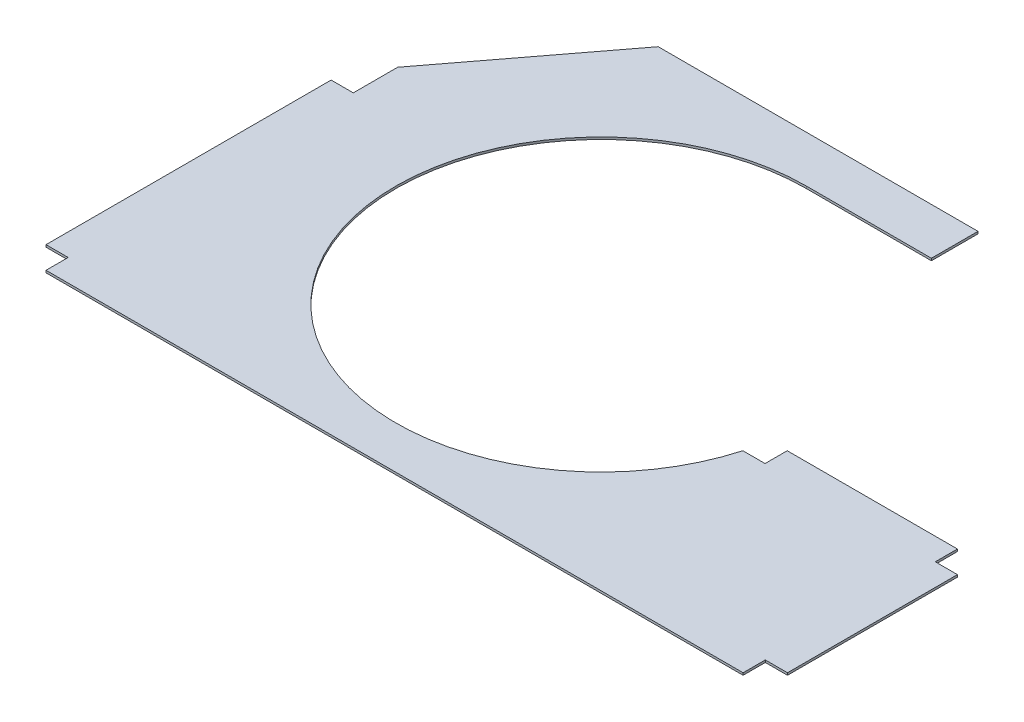
ISO-10303-21;
HEADER;
FILE_DESCRIPTION(('STEP AP214'),'2;1');
FILE_NAME('part.step','',(''),(''),'','','');
FILE_SCHEMA(('AUTOMOTIVE_DESIGN { 1 0 10303 214 1 1 1 1 }'));
ENDSEC;
DATA;
#1=APPLICATION_CONTEXT('core data for automotive mechanical design processes');
#2=APPLICATION_PROTOCOL_DEFINITION('international standard','automotive_design',2000,#1);
#3=PRODUCT_CONTEXT('',#1,'mechanical');
#4=PRODUCT('Part','Part','',(#3));
#5=PRODUCT_RELATED_PRODUCT_CATEGORY('part','',(#4));
#6=PRODUCT_DEFINITION_FORMATION('','',#4);
#7=PRODUCT_DEFINITION_CONTEXT('part definition',#1,'design');
#8=PRODUCT_DEFINITION('design','',#6,#7);
#9=PRODUCT_DEFINITION_SHAPE('','',#8);
#10=(LENGTH_UNIT() NAMED_UNIT(*) SI_UNIT(.MILLI.,.METRE.));
#11=(NAMED_UNIT(*) PLANE_ANGLE_UNIT() SI_UNIT($,.RADIAN.));
#12=(NAMED_UNIT(*) SI_UNIT($,.STERADIAN.) SOLID_ANGLE_UNIT());
#13=UNCERTAINTY_MEASURE_WITH_UNIT(LENGTH_MEASURE(1.E-05),#10,'distance_accuracy_value','');
#14=(GEOMETRIC_REPRESENTATION_CONTEXT(3) GLOBAL_UNCERTAINTY_ASSIGNED_CONTEXT((#13)) GLOBAL_UNIT_ASSIGNED_CONTEXT((#10,
#11,#12)) REPRESENTATION_CONTEXT('',''));
#15=CARTESIAN_POINT('',(0.,0.,0.));
#16=DIRECTION('',(0.,0.,1.));
#17=DIRECTION('',(1.,0.,0.));
#18=AXIS2_PLACEMENT_3D('',#15,#16,#17);
#19=CARTESIAN_POINT('',(0.,2.,0.));
#20=DIRECTION('',(1.,0.,0.));
#21=DIRECTION('',(0.,0.,-1.));
#22=AXIS2_PLACEMENT_3D('',#19,#20,#21);
#23=PLANE('',#22);
#24=DIRECTION('',(0.,0.,1.));
#25=VECTOR('',#24,1.);
#26=CARTESIAN_POINT('',(0.,0.,0.));
#27=LINE('',#26,#25);
#28=CARTESIAN_POINT('',(0.,0.,-257.));
#29=VERTEX_POINT('',#28);
#30=CARTESIAN_POINT('',(0.,0.,0.));
#31=VERTEX_POINT('',#30);
#32=EDGE_CURVE('E203',#29,#31,#27,.T.);
#33=ORIENTED_EDGE('',*,*,#32,.T.);
#34=DIRECTION('',(0.,-1.,0.));
#35=VECTOR('',#34,1.);
#36=CARTESIAN_POINT('',(0.,2.,0.));
#37=LINE('',#36,#35);
#38=CARTESIAN_POINT('',(0.,2.,0.));
#39=VERTEX_POINT('',#38);
#40=EDGE_CURVE('E11',#39,#31,#37,.T.);
#41=ORIENTED_EDGE('',*,*,#40,.F.);
#42=DIRECTION('',(0.,0.,1.));
#43=VECTOR('',#42,1.);
#44=CARTESIAN_POINT('',(0.,2.,0.));
#45=LINE('',#44,#43);
#46=CARTESIAN_POINT('',(0.,2.,-257.));
#47=VERTEX_POINT('',#46);
#48=EDGE_CURVE('E240',#47,#39,#45,.T.);
#49=ORIENTED_EDGE('',*,*,#48,.F.);
#50=DIRECTION('',(0.,-1.,0.));
#51=VECTOR('',#50,1.);
#52=CARTESIAN_POINT('',(0.,2.,-257.));
#53=LINE('',#52,#51);
#54=EDGE_CURVE('E197',#47,#29,#53,.T.);
#55=ORIENTED_EDGE('',*,*,#54,.T.);
#56=EDGE_LOOP('',(#33,#41,#49,#55));
#57=FACE_BOUND('',#56,.T.);
#58=ADVANCED_FACE('F39',(#57),#23,.F.);
#59=CARTESIAN_POINT('',(0.,2.,0.));
#60=DIRECTION('',(0.,0.,-1.));
#61=DIRECTION('',(-1.,0.,0.));
#62=AXIS2_PLACEMENT_3D('',#59,#60,#61);
#63=PLANE('',#62);
#64=DIRECTION('',(1.,0.,0.));
#65=VECTOR('',#64,1.);
#66=CARTESIAN_POINT('',(0.,0.,0.));
#67=LINE('',#66,#65);
#68=CARTESIAN_POINT('',(20.,0.,0.));
#69=VERTEX_POINT('',#68);
#70=EDGE_CURVE('E204',#31,#69,#67,.T.);
#71=ORIENTED_EDGE('',*,*,#70,.T.);
#72=DIRECTION('',(0.,-1.,0.));
#73=VECTOR('',#72,1.);
#74=CARTESIAN_POINT('',(20.,2.,0.));
#75=LINE('',#74,#73);
#76=CARTESIAN_POINT('',(20.,2.,0.));
#77=VERTEX_POINT('',#76);
#78=EDGE_CURVE('E50',#77,#69,#75,.T.);
#79=ORIENTED_EDGE('',*,*,#78,.F.);
#80=DIRECTION('',(1.,0.,0.));
#81=VECTOR('',#80,1.);
#82=CARTESIAN_POINT('',(0.,2.,0.));
#83=LINE('',#82,#81);
#84=EDGE_CURVE('E133',#39,#77,#83,.T.);
#85=ORIENTED_EDGE('',*,*,#84,.F.);
#86=ORIENTED_EDGE('',*,*,#40,.T.);
#87=EDGE_LOOP('',(#71,#79,#85,#86));
#88=FACE_BOUND('',#87,.T.);
#89=ADVANCED_FACE('F348',(#88),#63,.F.);
#90=CARTESIAN_POINT('',(20.,2.,0.));
#91=DIRECTION('',(1.,0.,0.));
#92=DIRECTION('',(0.,0.,-1.));
#93=AXIS2_PLACEMENT_3D('',#90,#91,#92);
#94=PLANE('',#93);
#95=DIRECTION('',(0.,0.,1.));
#96=VECTOR('',#95,1.);
#97=CARTESIAN_POINT('',(20.,0.,0.));
#98=LINE('',#97,#96);
#99=CARTESIAN_POINT('',(20.,0.,20.));
#100=VERTEX_POINT('',#99);
#101=EDGE_CURVE('E206',#69,#100,#98,.T.);
#102=ORIENTED_EDGE('',*,*,#101,.T.);
#103=DIRECTION('',(0.,-1.,0.));
#104=VECTOR('',#103,1.);
#105=CARTESIAN_POINT('',(20.,2.,20.));
#106=LINE('',#105,#104);
#107=CARTESIAN_POINT('',(20.,2.,20.));
#108=VERTEX_POINT('',#107);
#109=EDGE_CURVE('E280',#108,#100,#106,.T.);
#110=ORIENTED_EDGE('',*,*,#109,.F.);
#111=DIRECTION('',(0.,0.,1.));
#112=VECTOR('',#111,1.);
#113=CARTESIAN_POINT('',(20.,2.,0.));
#114=LINE('',#113,#112);
#115=EDGE_CURVE('E281',#77,#108,#114,.T.);
#116=ORIENTED_EDGE('',*,*,#115,.F.);
#117=ORIENTED_EDGE('',*,*,#78,.T.);
#118=EDGE_LOOP('',(#102,#110,#116,#117));
#119=FACE_BOUND('',#118,.T.);
#120=ADVANCED_FACE('F282',(#119),#94,.F.);
#121=CARTESIAN_POINT('',(20.,2.,20.));
#122=DIRECTION('',(0.,0.,-1.));
#123=DIRECTION('',(-1.,0.,0.));
#124=AXIS2_PLACEMENT_3D('',#121,#122,#123);
#125=PLANE('',#124);
#126=DIRECTION('',(1.,0.,0.));
#127=VECTOR('',#126,1.);
#128=CARTESIAN_POINT('',(20.,0.,20.));
#129=LINE('',#128,#127);
#130=CARTESIAN_POINT('',(648.38,0.,20.));
#131=VERTEX_POINT('',#130);
#132=EDGE_CURVE('E208',#100,#131,#129,.T.);
#133=ORIENTED_EDGE('',*,*,#132,.T.);
#134=DIRECTION('',(0.,-1.,0.));
#135=VECTOR('',#134,1.);
#136=CARTESIAN_POINT('',(648.38,2.,20.));
#137=LINE('',#136,#135);
#138=CARTESIAN_POINT('',(648.38,2.,20.));
#139=VERTEX_POINT('',#138);
#140=EDGE_CURVE('E273',#139,#131,#137,.T.);
#141=ORIENTED_EDGE('',*,*,#140,.F.);
#142=DIRECTION('',(1.,0.,0.));
#143=VECTOR('',#142,1.);
#144=CARTESIAN_POINT('',(20.,2.,20.));
#145=LINE('',#144,#143);
#146=EDGE_CURVE('E304',#108,#139,#145,.T.);
#147=ORIENTED_EDGE('',*,*,#146,.F.);
#148=ORIENTED_EDGE('',*,*,#109,.T.);
#149=EDGE_LOOP('',(#133,#141,#147,#148));
#150=FACE_BOUND('',#149,.T.);
#151=ADVANCED_FACE('F294',(#150),#125,.F.);
#152=CARTESIAN_POINT('',(648.38,2.,20.));
#153=DIRECTION('',(-1.,0.,0.));
#154=DIRECTION('',(0.,0.,1.));
#155=AXIS2_PLACEMENT_3D('',#152,#153,#154);
#156=PLANE('',#155);
#157=DIRECTION('',(0.,0.,-1.));
#158=VECTOR('',#157,1.);
#159=CARTESIAN_POINT('',(648.38,0.,20.));
#160=LINE('',#159,#158);
#161=CARTESIAN_POINT('',(648.38,0.,0.));
#162=VERTEX_POINT('',#161);
#163=EDGE_CURVE('E209',#131,#162,#160,.T.);
#164=ORIENTED_EDGE('',*,*,#163,.T.);
#165=DIRECTION('',(0.,-1.,0.));
#166=VECTOR('',#165,1.);
#167=CARTESIAN_POINT('',(648.38,2.,0.));
#168=LINE('',#167,#166);
#169=CARTESIAN_POINT('',(648.38,2.,0.));
#170=VERTEX_POINT('',#169);
#171=EDGE_CURVE('E271',#170,#162,#168,.T.);
#172=ORIENTED_EDGE('',*,*,#171,.F.);
#173=DIRECTION('',(0.,0.,-1.));
#174=VECTOR('',#173,1.);
#175=CARTESIAN_POINT('',(648.38,2.,20.));
#176=LINE('',#175,#174);
#177=EDGE_CURVE('E296',#139,#170,#176,.T.);
#178=ORIENTED_EDGE('',*,*,#177,.F.);
#179=ORIENTED_EDGE('',*,*,#140,.T.);
#180=EDGE_LOOP('',(#164,#172,#178,#179));
#181=FACE_BOUND('',#180,.T.);
#182=ADVANCED_FACE('F297',(#181),#156,.F.);
#183=CARTESIAN_POINT('',(648.38,2.,0.));
#184=DIRECTION('',(0.,0.,-1.));
#185=DIRECTION('',(-1.,0.,0.));
#186=AXIS2_PLACEMENT_3D('',#183,#184,#185);
#187=PLANE('',#186);
#188=DIRECTION('',(1.,0.,0.));
#189=VECTOR('',#188,1.);
#190=CARTESIAN_POINT('',(648.38,0.,0.));
#191=LINE('',#190,#189);
#192=CARTESIAN_POINT('',(668.38,0.,0.));
#193=VERTEX_POINT('',#192);
#194=EDGE_CURVE('E215',#162,#193,#191,.T.);
#195=ORIENTED_EDGE('',*,*,#194,.T.);
#196=DIRECTION('',(0.,-1.,0.));
#197=VECTOR('',#196,1.);
#198=CARTESIAN_POINT('',(668.38,2.,0.));
#199=LINE('',#198,#197);
#200=CARTESIAN_POINT('',(668.38,2.,0.));
#201=VERTEX_POINT('',#200);
#202=EDGE_CURVE('E268',#201,#193,#199,.T.);
#203=ORIENTED_EDGE('',*,*,#202,.F.);
#204=DIRECTION('',(1.,0.,0.));
#205=VECTOR('',#204,1.);
#206=CARTESIAN_POINT('',(648.38,2.,0.));
#207=LINE('',#206,#205);
#208=EDGE_CURVE('E302',#170,#201,#207,.T.);
#209=ORIENTED_EDGE('',*,*,#208,.F.);
#210=ORIENTED_EDGE('',*,*,#171,.T.);
#211=EDGE_LOOP('',(#195,#203,#209,#210));
#212=FACE_BOUND('',#211,.T.);
#213=ADVANCED_FACE('F361',(#212),#187,.F.);
#214=CARTESIAN_POINT('',(668.38,2.,0.));
#215=DIRECTION('',(-1.,0.,0.));
#216=DIRECTION('',(0.,0.,1.));
#217=AXIS2_PLACEMENT_3D('',#214,#215,#216);
#218=PLANE('',#217);
#219=DIRECTION('',(0.,0.,-1.));
#220=VECTOR('',#219,1.);
#221=CARTESIAN_POINT('',(668.38,0.,0.));
#222=LINE('',#221,#220);
#223=CARTESIAN_POINT('',(668.38,0.,-153.21));
#224=VERTEX_POINT('',#223);
#225=EDGE_CURVE('E212',#193,#224,#222,.T.);
#226=ORIENTED_EDGE('',*,*,#225,.T.);
#227=DIRECTION('',(0.,-1.,0.));
#228=VECTOR('',#227,1.);
#229=CARTESIAN_POINT('',(668.38,2.,-153.21));
#230=LINE('',#229,#228);
#231=CARTESIAN_POINT('',(668.38,2.,-153.21));
#232=VERTEX_POINT('',#231);
#233=EDGE_CURVE('E264',#232,#224,#230,.T.);
#234=ORIENTED_EDGE('',*,*,#233,.F.);
#235=DIRECTION('',(0.,0.,-1.));
#236=VECTOR('',#235,1.);
#237=CARTESIAN_POINT('',(668.38,2.,0.));
#238=LINE('',#237,#236);
#239=EDGE_CURVE('E305',#201,#232,#238,.T.);
#240=ORIENTED_EDGE('',*,*,#239,.F.);
#241=ORIENTED_EDGE('',*,*,#202,.T.);
#242=EDGE_LOOP('',(#226,#234,#240,#241));
#243=FACE_BOUND('',#242,.T.);
#244=ADVANCED_FACE('F368',(#243),#218,.F.);
#245=CARTESIAN_POINT('',(668.38,2.,-153.21));
#246=DIRECTION('',(0.,0.,1.));
#247=DIRECTION('',(1.,0.,0.));
#248=AXIS2_PLACEMENT_3D('',#245,#246,#247);
#249=PLANE('',#248);
#250=DIRECTION('',(-1.,0.,0.));
#251=VECTOR('',#250,1.);
#252=CARTESIAN_POINT('',(668.38,0.,-153.21));
#253=LINE('',#252,#251);
#254=CARTESIAN_POINT('',(648.38,0.,-153.21));
#255=VERTEX_POINT('',#254);
#256=EDGE_CURVE('E216',#224,#255,#253,.T.);
#257=ORIENTED_EDGE('',*,*,#256,.T.);
#258=DIRECTION('',(0.,-1.,0.));
#259=VECTOR('',#258,1.);
#260=CARTESIAN_POINT('',(648.38,2.,-153.21));
#261=LINE('',#260,#259);
#262=CARTESIAN_POINT('',(648.38,2.,-153.21));
#263=VERTEX_POINT('',#262);
#264=EDGE_CURVE('E265',#263,#255,#261,.T.);
#265=ORIENTED_EDGE('',*,*,#264,.F.);
#266=DIRECTION('',(-1.,0.,0.));
#267=VECTOR('',#266,1.);
#268=CARTESIAN_POINT('',(668.38,2.,-153.21));
#269=LINE('',#268,#267);
#270=EDGE_CURVE('E313',#232,#263,#269,.T.);
#271=ORIENTED_EDGE('',*,*,#270,.F.);
#272=ORIENTED_EDGE('',*,*,#233,.T.);
#273=EDGE_LOOP('',(#257,#265,#271,#272));
#274=FACE_BOUND('',#273,.T.);
#275=ADVANCED_FACE('F367',(#274),#249,.F.);
#276=CARTESIAN_POINT('',(648.38,2.,-153.21));
#277=DIRECTION('',(-1.,0.,0.));
#278=DIRECTION('',(0.,0.,1.));
#279=AXIS2_PLACEMENT_3D('',#276,#277,#278);
#280=PLANE('',#279);
#281=DIRECTION('',(0.,0.,-1.));
#282=VECTOR('',#281,1.);
#283=CARTESIAN_POINT('',(648.38,0.,-153.21));
#284=LINE('',#283,#282);
#285=CARTESIAN_POINT('',(648.38,0.,-173.21));
#286=VERTEX_POINT('',#285);
#287=EDGE_CURVE('E217',#255,#286,#284,.T.);
#288=ORIENTED_EDGE('',*,*,#287,.T.);
#289=DIRECTION('',(0.,-1.,0.));
#290=VECTOR('',#289,1.);
#291=CARTESIAN_POINT('',(648.38,2.,-173.21));
#292=LINE('',#291,#290);
#293=CARTESIAN_POINT('',(648.38,2.,-173.21));
#294=VERTEX_POINT('',#293);
#295=EDGE_CURVE('E259',#294,#286,#292,.T.);
#296=ORIENTED_EDGE('',*,*,#295,.F.);
#297=DIRECTION('',(0.,0.,-1.));
#298=VECTOR('',#297,1.);
#299=CARTESIAN_POINT('',(648.38,2.,-153.21));
#300=LINE('',#299,#298);
#301=EDGE_CURVE('E311',#263,#294,#300,.T.);
#302=ORIENTED_EDGE('',*,*,#301,.F.);
#303=ORIENTED_EDGE('',*,*,#264,.T.);
#304=EDGE_LOOP('',(#288,#296,#302,#303));
#305=FACE_BOUND('',#304,.T.);
#306=ADVANCED_FACE('F372',(#305),#280,.F.);
#307=CARTESIAN_POINT('',(648.38,2.,-173.21));
#308=DIRECTION('',(0.,0.,1.));
#309=DIRECTION('',(1.,0.,0.));
#310=AXIS2_PLACEMENT_3D('',#307,#308,#309);
#311=PLANE('',#310);
#312=DIRECTION('',(-1.,0.,0.));
#313=VECTOR('',#312,1.);
#314=CARTESIAN_POINT('',(648.38,0.,-173.21));
#315=LINE('',#314,#313);
#316=CARTESIAN_POINT('',(494.944943632931,0.,-173.21));
#317=VERTEX_POINT('',#316);
#318=EDGE_CURVE('E219',#286,#317,#315,.T.);
#319=ORIENTED_EDGE('',*,*,#318,.T.);
#320=DIRECTION('',(0.,-1.,0.));
#321=VECTOR('',#320,1.);
#322=CARTESIAN_POINT('',(494.944943632931,2.,-173.21));
#323=LINE('',#322,#321);
#324=CARTESIAN_POINT('',(494.944943632931,2.,-173.21));
#325=VERTEX_POINT('',#324);
#326=EDGE_CURVE('E258',#325,#317,#323,.T.);
#327=ORIENTED_EDGE('',*,*,#326,.F.);
#328=DIRECTION('',(-1.,0.,0.));
#329=VECTOR('',#328,1.);
#330=CARTESIAN_POINT('',(648.38,2.,-173.21));
#331=LINE('',#330,#329);
#332=EDGE_CURVE('E312',#294,#325,#331,.T.);
#333=ORIENTED_EDGE('',*,*,#332,.F.);
#334=ORIENTED_EDGE('',*,*,#295,.T.);
#335=EDGE_LOOP('',(#319,#327,#333,#334));
#336=FACE_BOUND('',#335,.T.);
#337=ADVANCED_FACE('F378',(#336),#311,.F.);
#338=CARTESIAN_POINT('',(494.944943632931,2.,-173.21));
#339=DIRECTION('',(1.,0.,0.));
#340=DIRECTION('',(0.,0.,-1.));
#341=AXIS2_PLACEMENT_3D('',#338,#339,#340);
#342=PLANE('',#341);
#343=DIRECTION('',(0.,0.,1.));
#344=VECTOR('',#343,1.);
#345=CARTESIAN_POINT('',(494.944943632931,0.,-173.21));
#346=LINE('',#345,#344);
#347=CARTESIAN_POINT('',(494.944943632931,0.,-153.21));
#348=VERTEX_POINT('',#347);
#349=EDGE_CURVE('E225',#317,#348,#346,.T.);
#350=ORIENTED_EDGE('',*,*,#349,.T.);
#351=DIRECTION('',(0.,-1.,0.));
#352=VECTOR('',#351,1.);
#353=CARTESIAN_POINT('',(494.944943632931,2.,-153.21));
#354=LINE('',#353,#352);
#355=CARTESIAN_POINT('',(494.944943632931,2.,-153.21));
#356=VERTEX_POINT('',#355);
#357=EDGE_CURVE('E251',#356,#348,#354,.T.);
#358=ORIENTED_EDGE('',*,*,#357,.F.);
#359=DIRECTION('',(0.,0.,1.));
#360=VECTOR('',#359,1.);
#361=CARTESIAN_POINT('',(494.944943632931,2.,-173.21));
#362=LINE('',#361,#360);
#363=EDGE_CURVE('E320',#325,#356,#362,.T.);
#364=ORIENTED_EDGE('',*,*,#363,.F.);
#365=ORIENTED_EDGE('',*,*,#326,.T.);
#366=EDGE_LOOP('',(#350,#358,#364,#365));
#367=FACE_BOUND('',#366,.T.);
#368=ADVANCED_FACE('F385',(#367),#342,.F.);
#369=CARTESIAN_POINT('',(494.944943632931,2.,-153.21));
#370=DIRECTION('',(0.,0.,1.));
#371=DIRECTION('',(1.,0.,0.));
#372=AXIS2_PLACEMENT_3D('',#369,#370,#371);
#373=PLANE('',#372);
#374=DIRECTION('',(-1.,0.,0.));
#375=VECTOR('',#374,1.);
#376=CARTESIAN_POINT('',(494.944943632931,0.,-153.21));
#377=LINE('',#376,#375);
#378=CARTESIAN_POINT('',(474.944943632931,0.,-153.21));
#379=VERTEX_POINT('',#378);
#380=EDGE_CURVE('E221',#348,#379,#377,.T.);
#381=ORIENTED_EDGE('',*,*,#380,.T.);
#382=DIRECTION('',(0.,-1.,0.));
#383=VECTOR('',#382,1.);
#384=CARTESIAN_POINT('',(474.944943632931,2.,-153.21));
#385=LINE('',#384,#383);
#386=CARTESIAN_POINT('',(474.944943632931,2.,-153.21));
#387=VERTEX_POINT('',#386);
#388=EDGE_CURVE('E250',#387,#379,#385,.T.);
#389=ORIENTED_EDGE('',*,*,#388,.F.);
#390=DIRECTION('',(-1.,0.,0.));
#391=VECTOR('',#390,1.);
#392=CARTESIAN_POINT('',(494.944943632931,2.,-153.21));
#393=LINE('',#392,#391);
#394=EDGE_CURVE('E317',#356,#387,#393,.T.);
#395=ORIENTED_EDGE('',*,*,#394,.F.);
#396=ORIENTED_EDGE('',*,*,#357,.T.);
#397=EDGE_LOOP('',(#381,#389,#395,#396));
#398=FACE_BOUND('',#397,.T.);
#399=ADVANCED_FACE('F387',(#398),#373,.F.);
#400=CARTESIAN_POINT('',(296.9,2.,-203.45935867));
#401=DIRECTION('',(0.,-1.,0.));
#402=DIRECTION('',(0.,0.,-1.));
#403=AXIS2_PLACEMENT_3D('',#400,#401,#402);
#404=CYLINDRICAL_SURFACE('',#403,185.);
#405=CARTESIAN_POINT('',(296.9,0.,-203.45935867));
#406=DIRECTION('',(0.,-1.,0.));
#407=DIRECTION('',(0.,0.,-1.));
#408=AXIS2_PLACEMENT_3D('',#405,#406,#407);
#409=CIRCLE('',#408,185.);
#410=CARTESIAN_POINT('',(296.9,0.,-388.45935867));
#411=VERTEX_POINT('',#410);
#412=EDGE_CURVE('E228',#379,#411,#409,.T.);
#413=ORIENTED_EDGE('',*,*,#412,.T.);
#414=DIRECTION('',(0.,-1.,0.));
#415=VECTOR('',#414,1.);
#416=CARTESIAN_POINT('',(296.9,2.,-388.45935867));
#417=LINE('',#416,#415);
#418=CARTESIAN_POINT('',(296.9,2.,-388.45935867));
#419=VERTEX_POINT('',#418);
#420=EDGE_CURVE('E247',#419,#411,#417,.T.);
#421=ORIENTED_EDGE('',*,*,#420,.F.);
#422=CARTESIAN_POINT('',(296.9,2.,-203.45935867));
#423=DIRECTION('',(0.,-1.,0.));
#424=DIRECTION('',(0.,0.,-1.));
#425=AXIS2_PLACEMENT_3D('',#422,#423,#424);
#426=CIRCLE('',#425,185.);
#427=EDGE_CURVE('E321',#387,#419,#426,.T.);
#428=ORIENTED_EDGE('',*,*,#427,.F.);
#429=ORIENTED_EDGE('',*,*,#388,.T.);
#430=EDGE_LOOP('',(#413,#421,#428,#429));
#431=FACE_BOUND('',#430,.T.);
#432=ADVANCED_FACE('F388',(#431),#404,.F.);
#433=CARTESIAN_POINT('',(296.9,2.,-388.45935867));
#434=DIRECTION('',(0.,0.,-1.));
#435=DIRECTION('',(-1.,0.,0.));
#436=AXIS2_PLACEMENT_3D('',#433,#434,#435);
#437=PLANE('',#436);
#438=DIRECTION('',(1.,0.,0.));
#439=VECTOR('',#438,1.);
#440=CARTESIAN_POINT('',(296.9,0.,-388.45935867));
#441=LINE('',#440,#439);
#442=CARTESIAN_POINT('',(409.658335611747,0.,-388.45935867));
#443=VERTEX_POINT('',#442);
#444=EDGE_CURVE('E227',#411,#443,#441,.T.);
#445=ORIENTED_EDGE('',*,*,#444,.T.);
#446=DIRECTION('',(0.,-1.,0.));
#447=VECTOR('',#446,1.);
#448=CARTESIAN_POINT('',(409.658335611747,2.,-388.45935867));
#449=LINE('',#448,#447);
#450=CARTESIAN_POINT('',(409.658335611747,2.,-388.45935867));
#451=VERTEX_POINT('',#450);
#452=EDGE_CURVE('E245',#451,#443,#449,.T.);
#453=ORIENTED_EDGE('',*,*,#452,.F.);
#454=DIRECTION('',(1.,0.,0.));
#455=VECTOR('',#454,1.);
#456=CARTESIAN_POINT('',(296.9,2.,-388.45935867));
#457=LINE('',#456,#455);
#458=EDGE_CURVE('E323',#419,#451,#457,.T.);
#459=ORIENTED_EDGE('',*,*,#458,.F.);
#460=ORIENTED_EDGE('',*,*,#420,.T.);
#461=EDGE_LOOP('',(#445,#453,#459,#460));
#462=FACE_BOUND('',#461,.T.);
#463=ADVANCED_FACE('F395',(#462),#437,.F.);
#464=CARTESIAN_POINT('',(409.658335611747,2.,-430.45935867));
#465=DIRECTION('',(-1.,0.,0.));
#466=DIRECTION('',(0.,0.,1.));
#467=AXIS2_PLACEMENT_3D('',#464,#465,#466);
#468=PLANE('',#467);
#469=DIRECTION('',(0.,0.,-1.));
#470=VECTOR('',#469,1.);
#471=CARTESIAN_POINT('',(409.658335611747,0.,-430.45935867));
#472=LINE('',#471,#470);
#473=CARTESIAN_POINT('',(409.658335611747,0.,-430.45935867));
#474=VERTEX_POINT('',#473);
#475=EDGE_CURVE('E226',#443,#474,#472,.T.);
#476=ORIENTED_EDGE('',*,*,#475,.T.);
#477=DIRECTION('',(0.,-1.,0.));
#478=VECTOR('',#477,1.);
#479=CARTESIAN_POINT('',(409.658335611747,2.,-430.45935867));
#480=LINE('',#479,#478);
#481=CARTESIAN_POINT('',(409.658335611747,2.,-430.45935867));
#482=VERTEX_POINT('',#481);
#483=EDGE_CURVE('E243',#482,#474,#480,.T.);
#484=ORIENTED_EDGE('',*,*,#483,.F.);
#485=DIRECTION('',(0.,0.,-1.));
#486=VECTOR('',#485,1.);
#487=CARTESIAN_POINT('',(409.658335611747,2.,-430.45935867));
#488=LINE('',#487,#486);
#489=EDGE_CURVE('E324',#451,#482,#488,.T.);
#490=ORIENTED_EDGE('',*,*,#489,.F.);
#491=ORIENTED_EDGE('',*,*,#452,.T.);
#492=EDGE_LOOP('',(#476,#484,#490,#491));
#493=FACE_BOUND('',#492,.T.);
#494=ADVANCED_FACE('F332',(#493),#468,.F.);
#495=CARTESIAN_POINT('',(121.389532071709,2.,-430.45935867));
#496=DIRECTION('',(0.,0.,1.));
#497=DIRECTION('',(1.,0.,0.));
#498=AXIS2_PLACEMENT_3D('',#495,#496,#497);
#499=PLANE('',#498);
#500=DIRECTION('',(-1.,0.,0.));
#501=VECTOR('',#500,1.);
#502=CARTESIAN_POINT('',(121.389532071709,0.,-430.45935867));
#503=LINE('',#502,#501);
#504=CARTESIAN_POINT('',(121.389532071709,0.,-430.45935867));
#505=VERTEX_POINT('',#504);
#506=EDGE_CURVE('E232',#474,#505,#503,.T.);
#507=ORIENTED_EDGE('',*,*,#506,.T.);
#508=DIRECTION('',(0.,-1.,0.));
#509=VECTOR('',#508,1.);
#510=CARTESIAN_POINT('',(121.389532071709,2.,-430.45935867));
#511=LINE('',#510,#509);
#512=CARTESIAN_POINT('',(121.389532071709,2.,-430.45935867));
#513=VERTEX_POINT('',#512);
#514=EDGE_CURVE('E192',#513,#505,#511,.T.);
#515=ORIENTED_EDGE('',*,*,#514,.F.);
#516=DIRECTION('',(-1.,0.,0.));
#517=VECTOR('',#516,1.);
#518=CARTESIAN_POINT('',(121.389532071709,2.,-430.45935867));
#519=LINE('',#518,#517);
#520=EDGE_CURVE('E181',#482,#513,#519,.T.);
#521=ORIENTED_EDGE('',*,*,#520,.F.);
#522=ORIENTED_EDGE('',*,*,#483,.T.);
#523=EDGE_LOOP('',(#507,#515,#521,#522));
#524=FACE_BOUND('',#523,.T.);
#525=ADVANCED_FACE('F333',(#524),#499,.F.);
#526=CARTESIAN_POINT('',(20.,2.,-297.));
#527=DIRECTION('',(0.796275946112922,0.,0.604933564651501));
#528=DIRECTION('',(0.604933564651501,0.,-0.796275946112922));
#529=AXIS2_PLACEMENT_3D('',#526,#527,#528);
#530=PLANE('',#529);
#531=DIRECTION('',(-0.604933564651501,0.,0.796275946112922));
#532=VECTOR('',#531,1.);
#533=CARTESIAN_POINT('',(20.,0.,-297.));
#534=LINE('',#533,#532);
#535=CARTESIAN_POINT('',(20.,0.,-297.));
#536=VERTEX_POINT('',#535);
#537=EDGE_CURVE('E191',#505,#536,#534,.T.);
#538=ORIENTED_EDGE('',*,*,#537,.T.);
#539=DIRECTION('',(0.,-1.,0.));
#540=VECTOR('',#539,1.);
#541=CARTESIAN_POINT('',(20.,2.,-297.));
#542=LINE('',#541,#540);
#543=CARTESIAN_POINT('',(20.,2.,-297.));
#544=VERTEX_POINT('',#543);
#545=EDGE_CURVE('E187',#544,#536,#542,.T.);
#546=ORIENTED_EDGE('',*,*,#545,.F.);
#547=DIRECTION('',(-0.604933564651501,0.,0.796275946112922));
#548=VECTOR('',#547,1.);
#549=CARTESIAN_POINT('',(20.,2.,-297.));
#550=LINE('',#549,#548);
#551=EDGE_CURVE('E177',#513,#544,#550,.T.);
#552=ORIENTED_EDGE('',*,*,#551,.F.);
#553=ORIENTED_EDGE('',*,*,#514,.T.);
#554=EDGE_LOOP('',(#538,#546,#552,#553));
#555=FACE_BOUND('',#554,.T.);
#556=ADVANCED_FACE('F190',(#555),#530,.F.);
#557=CARTESIAN_POINT('',(20.,2.,-257.));
#558=DIRECTION('',(1.,0.,0.));
#559=DIRECTION('',(0.,0.,-1.));
#560=AXIS2_PLACEMENT_3D('',#557,#558,#559);
#561=PLANE('',#560);
#562=DIRECTION('',(0.,0.,1.));
#563=VECTOR('',#562,1.);
#564=CARTESIAN_POINT('',(20.,0.,-257.));
#565=LINE('',#564,#563);
#566=CARTESIAN_POINT('',(20.,0.,-257.));
#567=VERTEX_POINT('',#566);
#568=EDGE_CURVE('E119',#536,#567,#565,.T.);
#569=ORIENTED_EDGE('',*,*,#568,.T.);
#570=DIRECTION('',(0.,-1.,0.));
#571=VECTOR('',#570,1.);
#572=CARTESIAN_POINT('',(20.,2.,-257.));
#573=LINE('',#572,#571);
#574=CARTESIAN_POINT('',(20.,2.,-257.));
#575=VERTEX_POINT('',#574);
#576=EDGE_CURVE('E194',#575,#567,#573,.T.);
#577=ORIENTED_EDGE('',*,*,#576,.F.);
#578=DIRECTION('',(0.,0.,1.));
#579=VECTOR('',#578,1.);
#580=CARTESIAN_POINT('',(20.,2.,-257.));
#581=LINE('',#580,#579);
#582=EDGE_CURVE('E182',#544,#575,#581,.T.);
#583=ORIENTED_EDGE('',*,*,#582,.F.);
#584=ORIENTED_EDGE('',*,*,#545,.T.);
#585=EDGE_LOOP('',(#569,#577,#583,#584));
#586=FACE_BOUND('',#585,.T.);
#587=ADVANCED_FACE('F195',(#586),#561,.F.);
#588=CARTESIAN_POINT('',(0.,2.,-257.));
#589=DIRECTION('',(0.,0.,1.));
#590=DIRECTION('',(1.,0.,0.));
#591=AXIS2_PLACEMENT_3D('',#588,#589,#590);
#592=PLANE('',#591);
#593=DIRECTION('',(-1.,0.,0.));
#594=VECTOR('',#593,1.);
#595=CARTESIAN_POINT('',(0.,0.,-257.));
#596=LINE('',#595,#594);
#597=EDGE_CURVE('E124',#567,#29,#596,.T.);
#598=ORIENTED_EDGE('',*,*,#597,.T.);
#599=ORIENTED_EDGE('',*,*,#54,.F.);
#600=DIRECTION('',(-1.,0.,0.));
#601=VECTOR('',#600,1.);
#602=CARTESIAN_POINT('',(0.,2.,-257.));
#603=LINE('',#602,#601);
#604=EDGE_CURVE('E54',#575,#47,#603,.T.);
#605=ORIENTED_EDGE('',*,*,#604,.F.);
#606=ORIENTED_EDGE('',*,*,#576,.T.);
#607=EDGE_LOOP('',(#598,#599,#605,#606));
#608=FACE_BOUND('',#607,.T.);
#609=ADVANCED_FACE('F340',(#608),#592,.F.);
#610=CARTESIAN_POINT('',(296.9,2.,-203.45935867));
#611=DIRECTION('',(0.,-1.,0.));
#612=DIRECTION('',(0.,0.,-1.));
#613=AXIS2_PLACEMENT_3D('',#610,#611,#612);
#614=PLANE('',#613);
#615=ORIENTED_EDGE('',*,*,#48,.T.);
#616=ORIENTED_EDGE('',*,*,#84,.T.);
#617=ORIENTED_EDGE('',*,*,#115,.T.);
#618=ORIENTED_EDGE('',*,*,#146,.T.);
#619=ORIENTED_EDGE('',*,*,#177,.T.);
#620=ORIENTED_EDGE('',*,*,#208,.T.);
#621=ORIENTED_EDGE('',*,*,#239,.T.);
#622=ORIENTED_EDGE('',*,*,#270,.T.);
#623=ORIENTED_EDGE('',*,*,#301,.T.);
#624=ORIENTED_EDGE('',*,*,#332,.T.);
#625=ORIENTED_EDGE('',*,*,#363,.T.);
#626=ORIENTED_EDGE('',*,*,#394,.T.);
#627=ORIENTED_EDGE('',*,*,#427,.T.);
#628=ORIENTED_EDGE('',*,*,#458,.T.);
#629=ORIENTED_EDGE('',*,*,#489,.T.);
#630=ORIENTED_EDGE('',*,*,#520,.T.);
#631=ORIENTED_EDGE('',*,*,#551,.T.);
#632=ORIENTED_EDGE('',*,*,#582,.T.);
#633=ORIENTED_EDGE('',*,*,#604,.T.);
#634=EDGE_LOOP('',(#615,#616,#617,#618,#619,#620,#621,#622,#623,#624,#625,#626,#627,#628,#629,
#630,#631,#632,#633));
#635=FACE_BOUND('',#634,.T.);
#636=ADVANCED_FACE('F178',(#635),#614,.F.);
#637=CARTESIAN_POINT('',(296.9,0.,-203.45935867));
#638=DIRECTION('',(0.,-1.,0.));
#639=DIRECTION('',(0.,0.,-1.));
#640=AXIS2_PLACEMENT_3D('',#637,#638,#639);
#641=PLANE('',#640);
#642=ORIENTED_EDGE('',*,*,#32,.F.);
#643=ORIENTED_EDGE('',*,*,#597,.F.);
#644=ORIENTED_EDGE('',*,*,#568,.F.);
#645=ORIENTED_EDGE('',*,*,#537,.F.);
#646=ORIENTED_EDGE('',*,*,#506,.F.);
#647=ORIENTED_EDGE('',*,*,#475,.F.);
#648=ORIENTED_EDGE('',*,*,#444,.F.);
#649=ORIENTED_EDGE('',*,*,#412,.F.);
#650=ORIENTED_EDGE('',*,*,#380,.F.);
#651=ORIENTED_EDGE('',*,*,#349,.F.);
#652=ORIENTED_EDGE('',*,*,#318,.F.);
#653=ORIENTED_EDGE('',*,*,#287,.F.);
#654=ORIENTED_EDGE('',*,*,#256,.F.);
#655=ORIENTED_EDGE('',*,*,#225,.F.);
#656=ORIENTED_EDGE('',*,*,#194,.F.);
#657=ORIENTED_EDGE('',*,*,#163,.F.);
#658=ORIENTED_EDGE('',*,*,#132,.F.);
#659=ORIENTED_EDGE('',*,*,#101,.F.);
#660=ORIENTED_EDGE('',*,*,#70,.F.);
#661=EDGE_LOOP('',(#642,#643,#644,#645,#646,#647,#648,#649,#650,#651,#652,#653,#654,#655,#656,
#657,#658,#659,#660));
#662=FACE_BOUND('',#661,.T.);
#663=ADVANCED_FACE('F288',(#662),#641,.T.);
#664=CLOSED_SHELL('',(#58,#89,#120,#151,#182,#213,#244,#275,#306,#337,#368,#399,#432,#463,#494,
#525,#556,#587,#609,#636,#663));
#665=MANIFOLD_SOLID_BREP('B2',#664);
#666=ADVANCED_BREP_SHAPE_REPRESENTATION('',(#18,#665),#14);
#667=SHAPE_DEFINITION_REPRESENTATION(#9,#666);
ENDSEC;
END-ISO-10303-21;
